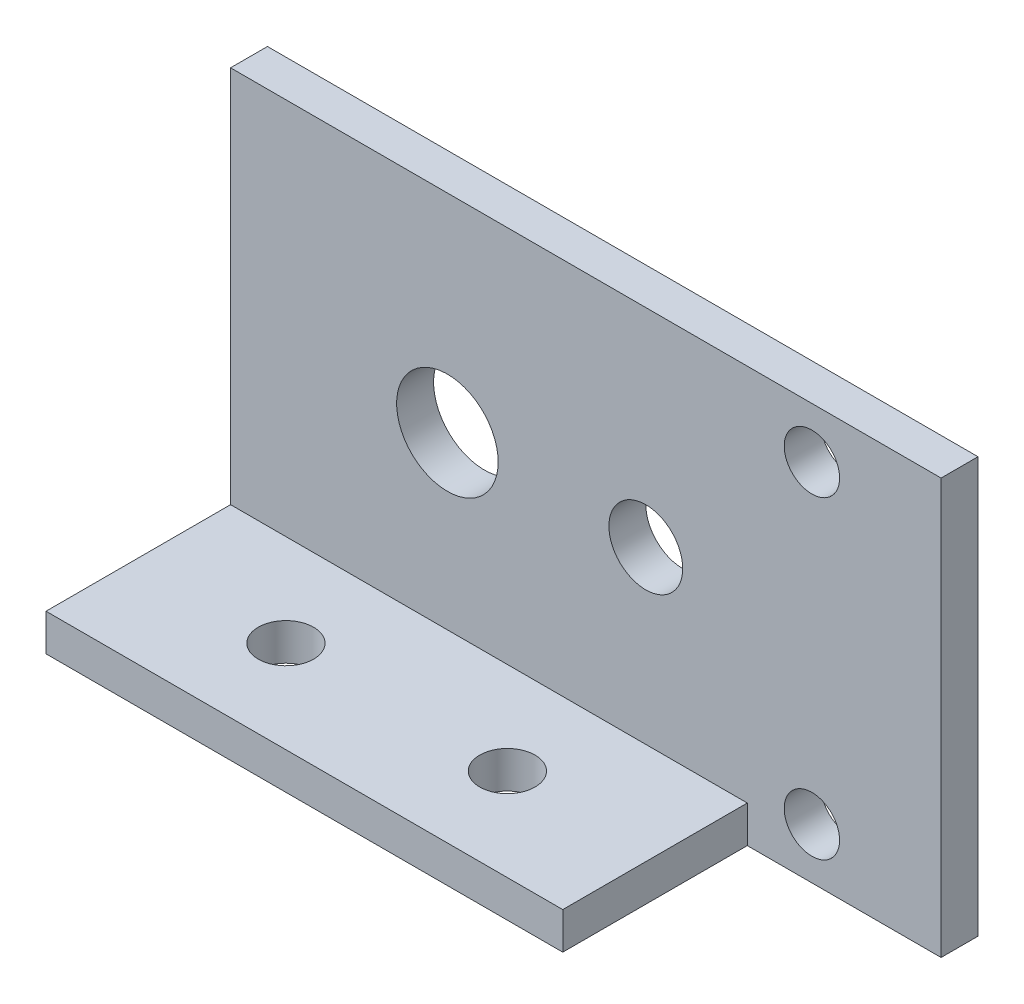
ISO-10303-21;
HEADER;
FILE_DESCRIPTION(('STEP AP214'),'2;1');
FILE_NAME('part.step','',(''),(''),'','','');
FILE_SCHEMA(('AUTOMOTIVE_DESIGN { 1 0 10303 214 1 1 1 1 }'));
ENDSEC;
DATA;
#1=APPLICATION_CONTEXT('core data for automotive mechanical design processes');
#2=APPLICATION_PROTOCOL_DEFINITION('international standard','automotive_design',2000,#1);
#3=PRODUCT_CONTEXT('',#1,'mechanical');
#4=PRODUCT('Part','Part','',(#3));
#5=PRODUCT_RELATED_PRODUCT_CATEGORY('part','',(#4));
#6=PRODUCT_DEFINITION_FORMATION('','',#4);
#7=PRODUCT_DEFINITION_CONTEXT('part definition',#1,'design');
#8=PRODUCT_DEFINITION('design','',#6,#7);
#9=PRODUCT_DEFINITION_SHAPE('','',#8);
#10=(LENGTH_UNIT() NAMED_UNIT(*) SI_UNIT(.MILLI.,.METRE.));
#11=(NAMED_UNIT(*) PLANE_ANGLE_UNIT() SI_UNIT($,.RADIAN.));
#12=(NAMED_UNIT(*) SI_UNIT($,.STERADIAN.) SOLID_ANGLE_UNIT());
#13=UNCERTAINTY_MEASURE_WITH_UNIT(LENGTH_MEASURE(1.E-05),#10,'distance_accuracy_value','');
#14=(GEOMETRIC_REPRESENTATION_CONTEXT(3) GLOBAL_UNCERTAINTY_ASSIGNED_CONTEXT((#13)) GLOBAL_UNIT_ASSIGNED_CONTEXT((#10,
#11,#12)) REPRESENTATION_CONTEXT('',''));
#15=CARTESIAN_POINT('',(0.,0.,0.));
#16=DIRECTION('',(0.,0.,1.));
#17=DIRECTION('',(1.,0.,0.));
#18=AXIS2_PLACEMENT_3D('',#15,#16,#17);
#19=CARTESIAN_POINT('',(0.,0.,2.));
#20=DIRECTION('',(0.,0.,1.));
#21=DIRECTION('',(1.,0.,0.));
#22=AXIS2_PLACEMENT_3D('',#19,#20,#21);
#23=PLANE('',#22);
#24=DIRECTION('',(-1.,0.,0.));
#25=VECTOR('',#24,1.);
#26=CARTESIAN_POINT('',(8.75,-9.25,2.));
#27=LINE('',#26,#25);
#28=CARTESIAN_POINT('',(8.75,-9.25,2.));
#29=VERTEX_POINT('',#28);
#30=CARTESIAN_POINT('',(-19.25,-9.25,2.));
#31=VERTEX_POINT('',#30);
#32=EDGE_CURVE('E127',#29,#31,#27,.T.);
#33=ORIENTED_EDGE('',*,*,#32,.F.);
#34=DIRECTION('',(0.,-1.,0.));
#35=VECTOR('',#34,1.);
#36=CARTESIAN_POINT('',(8.75,-11.25,2.));
#37=LINE('',#36,#35);
#38=CARTESIAN_POINT('',(8.74999999999999,-11.25,2.));
#39=VERTEX_POINT('',#38);
#40=EDGE_CURVE('E118',#29,#39,#37,.T.);
#41=ORIENTED_EDGE('',*,*,#40,.T.);
#42=DIRECTION('',(1.,0.,0.));
#43=VECTOR('',#42,1.);
#44=CARTESIAN_POINT('',(-19.25,-11.25,2.));
#45=LINE('',#44,#43);
#46=CARTESIAN_POINT('',(19.25,-11.25,2.));
#47=VERTEX_POINT('',#46);
#48=EDGE_CURVE('E58',#39,#47,#45,.T.);
#49=ORIENTED_EDGE('',*,*,#48,.T.);
#50=DIRECTION('',(0.,1.,0.));
#51=VECTOR('',#50,1.);
#52=CARTESIAN_POINT('',(19.25,11.25,2.));
#53=LINE('',#52,#51);
#54=CARTESIAN_POINT('',(19.25,11.25,2.));
#55=VERTEX_POINT('',#54);
#56=EDGE_CURVE('E168',#47,#55,#53,.T.);
#57=ORIENTED_EDGE('',*,*,#56,.T.);
#58=DIRECTION('',(-1.,0.,0.));
#59=VECTOR('',#58,1.);
#60=CARTESIAN_POINT('',(-19.25,11.25,2.));
#61=LINE('',#60,#59);
#62=CARTESIAN_POINT('',(-19.25,11.25,2.));
#63=VERTEX_POINT('',#62);
#64=EDGE_CURVE('E84',#55,#63,#61,.T.);
#65=ORIENTED_EDGE('',*,*,#64,.T.);
#66=DIRECTION('',(0.,-1.,0.));
#67=VECTOR('',#66,1.);
#68=CARTESIAN_POINT('',(-19.25,11.25,2.));
#69=LINE('',#68,#67);
#70=EDGE_CURVE('E171',#63,#31,#69,.T.);
#71=ORIENTED_EDGE('',*,*,#70,.T.);
#72=EDGE_LOOP('',(#33,#41,#49,#57,#65,#71));
#73=FACE_BOUND('',#72,.T.);
#74=CARTESIAN_POINT('',(12.25,-8.5,2.));
#75=DIRECTION('',(0.,0.,1.));
#76=DIRECTION('',(1.,0.,0.));
#77=AXIS2_PLACEMENT_3D('',#74,#75,#76);
#78=CIRCLE('',#77,1.5);
#79=CARTESIAN_POINT('',(13.75,-8.5,2.));
#80=VERTEX_POINT('',#79);
#81=EDGE_CURVE('E150',#80,#80,#78,.T.);
#82=ORIENTED_EDGE('',*,*,#81,.F.);
#83=EDGE_LOOP('',(#82));
#84=FACE_BOUND('',#83,.T.);
#85=CARTESIAN_POINT('',(-7.5,0.,2.));
#86=DIRECTION('',(0.,0.,1.));
#87=DIRECTION('',(1.,0.,0.));
#88=AXIS2_PLACEMENT_3D('',#85,#86,#87);
#89=CIRCLE('',#88,2.75);
#90=CARTESIAN_POINT('',(-4.75,0.,2.));
#91=VERTEX_POINT('',#90);
#92=EDGE_CURVE('E162',#91,#91,#89,.T.);
#93=ORIENTED_EDGE('',*,*,#92,.F.);
#94=EDGE_LOOP('',(#93));
#95=FACE_BOUND('',#94,.T.);
#96=CARTESIAN_POINT('',(3.25,0.,2.));
#97=DIRECTION('',(0.,0.,1.));
#98=DIRECTION('',(1.,0.,0.));
#99=AXIS2_PLACEMENT_3D('',#96,#97,#98);
#100=CIRCLE('',#99,2.);
#101=CARTESIAN_POINT('',(5.25,0.,2.));
#102=VERTEX_POINT('',#101);
#103=EDGE_CURVE('E156',#102,#102,#100,.T.);
#104=ORIENTED_EDGE('',*,*,#103,.F.);
#105=EDGE_LOOP('',(#104));
#106=FACE_BOUND('',#105,.T.);
#107=CARTESIAN_POINT('',(12.25,8.5,2.));
#108=DIRECTION('',(0.,0.,1.));
#109=DIRECTION('',(1.,0.,0.));
#110=AXIS2_PLACEMENT_3D('',#107,#108,#109);
#111=CIRCLE('',#110,1.5);
#112=CARTESIAN_POINT('',(13.75,8.5,2.));
#113=VERTEX_POINT('',#112);
#114=EDGE_CURVE('E144',#113,#113,#111,.T.);
#115=ORIENTED_EDGE('',*,*,#114,.F.);
#116=EDGE_LOOP('',(#115));
#117=FACE_BOUND('',#116,.T.);
#118=ADVANCED_FACE('F33',(#73,#84,#95,#106,#117),#23,.T.);
#119=CARTESIAN_POINT('',(0.,0.,0.));
#120=DIRECTION('',(0.,0.,1.));
#121=DIRECTION('',(1.,0.,0.));
#122=AXIS2_PLACEMENT_3D('',#119,#120,#121);
#123=PLANE('',#122);
#124=CARTESIAN_POINT('',(12.25,-8.5,0.));
#125=DIRECTION('',(0.,0.,1.));
#126=DIRECTION('',(1.,0.,0.));
#127=AXIS2_PLACEMENT_3D('',#124,#125,#126);
#128=CIRCLE('',#127,1.5);
#129=CARTESIAN_POINT('',(13.75,-8.5,0.));
#130=VERTEX_POINT('',#129);
#131=EDGE_CURVE('E147',#130,#130,#128,.T.);
#132=ORIENTED_EDGE('',*,*,#131,.T.);
#133=EDGE_LOOP('',(#132));
#134=FACE_BOUND('',#133,.T.);
#135=CARTESIAN_POINT('',(-7.5,0.,0.));
#136=DIRECTION('',(0.,0.,1.));
#137=DIRECTION('',(1.,0.,0.));
#138=AXIS2_PLACEMENT_3D('',#135,#136,#137);
#139=CIRCLE('',#138,2.75);
#140=CARTESIAN_POINT('',(-4.75,0.,0.));
#141=VERTEX_POINT('',#140);
#142=EDGE_CURVE('E159',#141,#141,#139,.T.);
#143=ORIENTED_EDGE('',*,*,#142,.T.);
#144=EDGE_LOOP('',(#143));
#145=FACE_BOUND('',#144,.T.);
#146=DIRECTION('',(0.,1.,0.));
#147=VECTOR('',#146,1.);
#148=CARTESIAN_POINT('',(19.25,11.25,0.));
#149=LINE('',#148,#147);
#150=CARTESIAN_POINT('',(19.25,-11.25,0.));
#151=VERTEX_POINT('',#150);
#152=CARTESIAN_POINT('',(19.25,11.25,0.));
#153=VERTEX_POINT('',#152);
#154=EDGE_CURVE('E165',#151,#153,#149,.T.);
#155=ORIENTED_EDGE('',*,*,#154,.F.);
#156=DIRECTION('',(1.,0.,0.));
#157=VECTOR('',#156,1.);
#158=CARTESIAN_POINT('',(-19.25,-11.25,0.));
#159=LINE('',#158,#157);
#160=CARTESIAN_POINT('',(-19.25,-11.25,0.));
#161=VERTEX_POINT('',#160);
#162=EDGE_CURVE('E79',#161,#151,#159,.T.);
#163=ORIENTED_EDGE('',*,*,#162,.F.);
#164=DIRECTION('',(0.,-1.,0.));
#165=VECTOR('',#164,1.);
#166=CARTESIAN_POINT('',(-19.25,11.25,0.));
#167=LINE('',#166,#165);
#168=CARTESIAN_POINT('',(-19.25,11.25,0.));
#169=VERTEX_POINT('',#168);
#170=EDGE_CURVE('E191',#169,#161,#167,.T.);
#171=ORIENTED_EDGE('',*,*,#170,.F.);
#172=DIRECTION('',(-1.,0.,0.));
#173=VECTOR('',#172,1.);
#174=CARTESIAN_POINT('',(-19.25,11.25,0.));
#175=LINE('',#174,#173);
#176=EDGE_CURVE('E195',#153,#169,#175,.T.);
#177=ORIENTED_EDGE('',*,*,#176,.F.);
#178=EDGE_LOOP('',(#155,#163,#171,#177));
#179=FACE_BOUND('',#178,.T.);
#180=CARTESIAN_POINT('',(3.25,0.,0.));
#181=DIRECTION('',(0.,0.,1.));
#182=DIRECTION('',(1.,0.,0.));
#183=AXIS2_PLACEMENT_3D('',#180,#181,#182);
#184=CIRCLE('',#183,2.);
#185=CARTESIAN_POINT('',(5.25,0.,0.));
#186=VERTEX_POINT('',#185);
#187=EDGE_CURVE('E153',#186,#186,#184,.T.);
#188=ORIENTED_EDGE('',*,*,#187,.T.);
#189=EDGE_LOOP('',(#188));
#190=FACE_BOUND('',#189,.T.);
#191=CARTESIAN_POINT('',(12.25,8.5,0.));
#192=DIRECTION('',(0.,0.,1.));
#193=DIRECTION('',(1.,0.,0.));
#194=AXIS2_PLACEMENT_3D('',#191,#192,#193);
#195=CIRCLE('',#194,1.5);
#196=CARTESIAN_POINT('',(13.75,8.5,0.));
#197=VERTEX_POINT('',#196);
#198=EDGE_CURVE('E129',#197,#197,#195,.T.);
#199=ORIENTED_EDGE('',*,*,#198,.T.);
#200=EDGE_LOOP('',(#199));
#201=FACE_BOUND('',#200,.T.);
#202=ADVANCED_FACE('F193',(#134,#145,#179,#190,#201),#123,.F.);
#203=CARTESIAN_POINT('',(19.25,11.25,2.));
#204=DIRECTION('',(-1.,0.,0.));
#205=DIRECTION('',(0.,-1.,0.));
#206=AXIS2_PLACEMENT_3D('',#203,#204,#205);
#207=PLANE('',#206);
#208=ORIENTED_EDGE('',*,*,#154,.T.);
#209=DIRECTION('',(0.,0.,-1.));
#210=VECTOR('',#209,1.);
#211=CARTESIAN_POINT('',(19.25,11.25,2.));
#212=LINE('',#211,#210);
#213=EDGE_CURVE('E11',#55,#153,#212,.T.);
#214=ORIENTED_EDGE('',*,*,#213,.F.);
#215=ORIENTED_EDGE('',*,*,#56,.F.);
#216=DIRECTION('',(0.,0.,-1.));
#217=VECTOR('',#216,1.);
#218=CARTESIAN_POINT('',(19.25,-11.25,2.));
#219=LINE('',#218,#217);
#220=EDGE_CURVE('E178',#47,#151,#219,.T.);
#221=ORIENTED_EDGE('',*,*,#220,.T.);
#222=EDGE_LOOP('',(#208,#214,#215,#221));
#223=FACE_BOUND('',#222,.T.);
#224=ADVANCED_FACE('F35',(#223),#207,.F.);
#225=CARTESIAN_POINT('',(-19.25,11.25,2.));
#226=DIRECTION('',(0.,-1.,0.));
#227=DIRECTION('',(0.,0.,-1.));
#228=AXIS2_PLACEMENT_3D('',#225,#226,#227);
#229=PLANE('',#228);
#230=ORIENTED_EDGE('',*,*,#176,.T.);
#231=DIRECTION('',(0.,0.,-1.));
#232=VECTOR('',#231,1.);
#233=CARTESIAN_POINT('',(-19.25,11.25,2.));
#234=LINE('',#233,#232);
#235=EDGE_CURVE('E42',#63,#169,#234,.T.);
#236=ORIENTED_EDGE('',*,*,#235,.F.);
#237=ORIENTED_EDGE('',*,*,#64,.F.);
#238=ORIENTED_EDGE('',*,*,#213,.T.);
#239=EDGE_LOOP('',(#230,#236,#237,#238));
#240=FACE_BOUND('',#239,.T.);
#241=ADVANCED_FACE('F198',(#240),#229,.F.);
#242=CARTESIAN_POINT('',(-19.25,11.25,2.));
#243=DIRECTION('',(1.,0.,0.));
#244=DIRECTION('',(0.,0.,-1.));
#245=AXIS2_PLACEMENT_3D('',#242,#243,#244);
#246=PLANE('',#245);
#247=ORIENTED_EDGE('',*,*,#170,.T.);
#248=DIRECTION('',(0.,0.,-1.));
#249=VECTOR('',#248,1.);
#250=CARTESIAN_POINT('',(-19.25,-11.25,2.));
#251=LINE('',#250,#249);
#252=CARTESIAN_POINT('',(-19.25,-11.25,12.));
#253=VERTEX_POINT('',#252);
#254=EDGE_CURVE('E179',#253,#161,#251,.T.);
#255=ORIENTED_EDGE('',*,*,#254,.F.);
#256=DIRECTION('',(0.,1.,0.));
#257=VECTOR('',#256,1.);
#258=CARTESIAN_POINT('',(-19.25,-11.25,12.));
#259=LINE('',#258,#257);
#260=CARTESIAN_POINT('',(-19.25,-9.25,12.));
#261=VERTEX_POINT('',#260);
#262=EDGE_CURVE('E110',#253,#261,#259,.T.);
#263=ORIENTED_EDGE('',*,*,#262,.T.);
#264=DIRECTION('',(0.,0.,-1.));
#265=VECTOR('',#264,1.);
#266=CARTESIAN_POINT('',(-19.25,-9.25,2.));
#267=LINE('',#266,#265);
#268=EDGE_CURVE('E120',#261,#31,#267,.T.);
#269=ORIENTED_EDGE('',*,*,#268,.T.);
#270=ORIENTED_EDGE('',*,*,#70,.F.);
#271=ORIENTED_EDGE('',*,*,#235,.T.);
#272=EDGE_LOOP('',(#247,#255,#263,#269,#270,#271));
#273=FACE_BOUND('',#272,.T.);
#274=ADVANCED_FACE('F190',(#273),#246,.F.);
#275=CARTESIAN_POINT('',(-19.25,-11.25,2.));
#276=DIRECTION('',(0.,1.,0.));
#277=DIRECTION('',(0.,0.,1.));
#278=AXIS2_PLACEMENT_3D('',#275,#276,#277);
#279=PLANE('',#278);
#280=CARTESIAN_POINT('',(0.750000000000001,-11.25,7.));
#281=DIRECTION('',(0.,1.,0.));
#282=DIRECTION('',(0.,0.,1.));
#283=AXIS2_PLACEMENT_3D('',#280,#281,#282);
#284=CIRCLE('',#283,1.5);
#285=CARTESIAN_POINT('',(0.750000000000001,-11.25,8.5));
#286=VERTEX_POINT('',#285);
#287=EDGE_CURVE('E228',#286,#286,#284,.T.);
#288=ORIENTED_EDGE('',*,*,#287,.T.);
#289=EDGE_LOOP('',(#288));
#290=FACE_BOUND('',#289,.T.);
#291=CARTESIAN_POINT('',(-11.25,-11.25,7.));
#292=DIRECTION('',(0.,1.,0.));
#293=DIRECTION('',(0.,0.,1.));
#294=AXIS2_PLACEMENT_3D('',#291,#292,#293);
#295=CIRCLE('',#294,1.5);
#296=CARTESIAN_POINT('',(-11.25,-11.25,8.5));
#297=VERTEX_POINT('',#296);
#298=EDGE_CURVE('E136',#297,#297,#295,.T.);
#299=ORIENTED_EDGE('',*,*,#298,.T.);
#300=EDGE_LOOP('',(#299));
#301=FACE_BOUND('',#300,.T.);
#302=ORIENTED_EDGE('',*,*,#162,.T.);
#303=ORIENTED_EDGE('',*,*,#220,.F.);
#304=ORIENTED_EDGE('',*,*,#48,.F.);
#305=DIRECTION('',(0.,0.,1.));
#306=VECTOR('',#305,1.);
#307=CARTESIAN_POINT('',(8.75,-11.25,2.));
#308=LINE('',#307,#306);
#309=CARTESIAN_POINT('',(8.75,-11.25,12.));
#310=VERTEX_POINT('',#309);
#311=EDGE_CURVE('E50',#39,#310,#308,.T.);
#312=ORIENTED_EDGE('',*,*,#311,.T.);
#313=DIRECTION('',(-1.,0.,0.));
#314=VECTOR('',#313,1.);
#315=CARTESIAN_POINT('',(8.75,-11.25,12.));
#316=LINE('',#315,#314);
#317=EDGE_CURVE('E105',#310,#253,#316,.T.);
#318=ORIENTED_EDGE('',*,*,#317,.T.);
#319=ORIENTED_EDGE('',*,*,#254,.T.);
#320=EDGE_LOOP('',(#302,#303,#304,#312,#318,#319));
#321=FACE_BOUND('',#320,.T.);
#322=ADVANCED_FACE('F117',(#290,#301,#321),#279,.F.);
#323=CARTESIAN_POINT('',(-7.5,0.,2.));
#324=DIRECTION('',(0.,0.,-1.));
#325=DIRECTION('',(-1.,0.,0.));
#326=AXIS2_PLACEMENT_3D('',#323,#324,#325);
#327=CYLINDRICAL_SURFACE('',#326,2.75);
#328=ORIENTED_EDGE('',*,*,#92,.T.);
#329=EDGE_LOOP('',(#328));
#330=FACE_BOUND('',#329,.T.);
#331=ORIENTED_EDGE('',*,*,#142,.F.);
#332=EDGE_LOOP('',(#331));
#333=FACE_BOUND('',#332,.T.);
#334=ADVANCED_FACE('F215',(#330,#333),#327,.F.);
#335=CARTESIAN_POINT('',(3.25,0.,2.));
#336=DIRECTION('',(0.,0.,-1.));
#337=DIRECTION('',(-1.,0.,0.));
#338=AXIS2_PLACEMENT_3D('',#335,#336,#337);
#339=CYLINDRICAL_SURFACE('',#338,2.);
#340=ORIENTED_EDGE('',*,*,#103,.T.);
#341=EDGE_LOOP('',(#340));
#342=FACE_BOUND('',#341,.T.);
#343=ORIENTED_EDGE('',*,*,#187,.F.);
#344=EDGE_LOOP('',(#343));
#345=FACE_BOUND('',#344,.T.);
#346=ADVANCED_FACE('F223',(#342,#345),#339,.F.);
#347=CARTESIAN_POINT('',(12.25,-8.5,2.));
#348=DIRECTION('',(0.,0.,-1.));
#349=DIRECTION('',(-1.,0.,0.));
#350=AXIS2_PLACEMENT_3D('',#347,#348,#349);
#351=CYLINDRICAL_SURFACE('',#350,1.5);
#352=ORIENTED_EDGE('',*,*,#81,.T.);
#353=EDGE_LOOP('',(#352));
#354=FACE_BOUND('',#353,.T.);
#355=ORIENTED_EDGE('',*,*,#131,.F.);
#356=EDGE_LOOP('',(#355));
#357=FACE_BOUND('',#356,.T.);
#358=ADVANCED_FACE('F254',(#354,#357),#351,.F.);
#359=CARTESIAN_POINT('',(12.25,8.5,2.));
#360=DIRECTION('',(0.,0.,-1.));
#361=DIRECTION('',(-1.,0.,0.));
#362=AXIS2_PLACEMENT_3D('',#359,#360,#361);
#363=CYLINDRICAL_SURFACE('',#362,1.5);
#364=ORIENTED_EDGE('',*,*,#114,.T.);
#365=EDGE_LOOP('',(#364));
#366=FACE_BOUND('',#365,.T.);
#367=ORIENTED_EDGE('',*,*,#198,.F.);
#368=EDGE_LOOP('',(#367));
#369=FACE_BOUND('',#368,.T.);
#370=ADVANCED_FACE('F248',(#366,#369),#363,.F.);
#371=CARTESIAN_POINT('',(8.75,-9.25,2.));
#372=DIRECTION('',(0.,1.,0.));
#373=DIRECTION('',(0.,0.,1.));
#374=AXIS2_PLACEMENT_3D('',#371,#372,#373);
#375=PLANE('',#374);
#376=CARTESIAN_POINT('',(0.750000000000001,-9.25,7.));
#377=DIRECTION('',(0.,1.,0.));
#378=DIRECTION('',(0.,0.,1.));
#379=AXIS2_PLACEMENT_3D('',#376,#377,#378);
#380=CIRCLE('',#379,1.5);
#381=CARTESIAN_POINT('',(0.750000000000001,-9.25,8.5));
#382=VERTEX_POINT('',#381);
#383=EDGE_CURVE('E368',#382,#382,#380,.T.);
#384=ORIENTED_EDGE('',*,*,#383,.F.);
#385=EDGE_LOOP('',(#384));
#386=FACE_BOUND('',#385,.T.);
#387=CARTESIAN_POINT('',(-11.25,-9.25,7.));
#388=DIRECTION('',(0.,1.,0.));
#389=DIRECTION('',(0.,0.,1.));
#390=AXIS2_PLACEMENT_3D('',#387,#388,#389);
#391=CIRCLE('',#390,1.5);
#392=CARTESIAN_POINT('',(-11.25,-9.25,8.5));
#393=VERTEX_POINT('',#392);
#394=EDGE_CURVE('E139',#393,#393,#391,.T.);
#395=ORIENTED_EDGE('',*,*,#394,.F.);
#396=EDGE_LOOP('',(#395));
#397=FACE_BOUND('',#396,.T.);
#398=ORIENTED_EDGE('',*,*,#268,.F.);
#399=DIRECTION('',(-1.,0.,0.));
#400=VECTOR('',#399,1.);
#401=CARTESIAN_POINT('',(8.75,-9.25,12.));
#402=LINE('',#401,#400);
#403=CARTESIAN_POINT('',(8.75,-9.25,12.));
#404=VERTEX_POINT('',#403);
#405=EDGE_CURVE('E111',#404,#261,#402,.T.);
#406=ORIENTED_EDGE('',*,*,#405,.F.);
#407=DIRECTION('',(0.,0.,-1.));
#408=VECTOR('',#407,1.);
#409=CARTESIAN_POINT('',(8.75,-9.25,2.));
#410=LINE('',#409,#408);
#411=EDGE_CURVE('E112',#404,#29,#410,.T.);
#412=ORIENTED_EDGE('',*,*,#411,.T.);
#413=ORIENTED_EDGE('',*,*,#32,.T.);
#414=EDGE_LOOP('',(#398,#406,#412,#413));
#415=FACE_BOUND('',#414,.T.);
#416=ADVANCED_FACE('F245',(#386,#397,#415),#375,.T.);
#417=CARTESIAN_POINT('',(8.75,-11.25,12.));
#418=DIRECTION('',(0.,0.,1.));
#419=DIRECTION('',(1.,0.,0.));
#420=AXIS2_PLACEMENT_3D('',#417,#418,#419);
#421=PLANE('',#420);
#422=ORIENTED_EDGE('',*,*,#262,.F.);
#423=ORIENTED_EDGE('',*,*,#317,.F.);
#424=DIRECTION('',(0.,1.,0.));
#425=VECTOR('',#424,1.);
#426=CARTESIAN_POINT('',(8.75,-11.25,12.));
#427=LINE('',#426,#425);
#428=EDGE_CURVE('E107',#310,#404,#427,.T.);
#429=ORIENTED_EDGE('',*,*,#428,.T.);
#430=ORIENTED_EDGE('',*,*,#405,.T.);
#431=EDGE_LOOP('',(#422,#423,#429,#430));
#432=FACE_BOUND('',#431,.T.);
#433=ADVANCED_FACE('F106',(#432),#421,.T.);
#434=CARTESIAN_POINT('',(8.75,0.,0.));
#435=DIRECTION('',(1.,0.,0.));
#436=DIRECTION('',(0.,0.,-1.));
#437=AXIS2_PLACEMENT_3D('',#434,#435,#436);
#438=PLANE('',#437);
#439=ORIENTED_EDGE('',*,*,#40,.F.);
#440=ORIENTED_EDGE('',*,*,#411,.F.);
#441=ORIENTED_EDGE('',*,*,#428,.F.);
#442=ORIENTED_EDGE('',*,*,#311,.F.);
#443=EDGE_LOOP('',(#439,#440,#441,#442));
#444=FACE_BOUND('',#443,.T.);
#445=ADVANCED_FACE('F114',(#444),#438,.T.);
#446=CARTESIAN_POINT('',(-11.25,-14.25,7.));
#447=DIRECTION('',(0.,1.,0.));
#448=DIRECTION('',(0.,0.,1.));
#449=AXIS2_PLACEMENT_3D('',#446,#447,#448);
#450=CYLINDRICAL_SURFACE('',#449,1.5);
#451=ORIENTED_EDGE('',*,*,#394,.T.);
#452=EDGE_LOOP('',(#451));
#453=FACE_BOUND('',#452,.T.);
#454=ORIENTED_EDGE('',*,*,#298,.F.);
#455=EDGE_LOOP('',(#454));
#456=FACE_BOUND('',#455,.T.);
#457=ADVANCED_FACE('F231',(#453,#456),#450,.F.);
#458=CARTESIAN_POINT('',(0.750000000000001,-14.25,7.));
#459=DIRECTION('',(0.,1.,0.));
#460=DIRECTION('',(0.,0.,1.));
#461=AXIS2_PLACEMENT_3D('',#458,#459,#460);
#462=CYLINDRICAL_SURFACE('',#461,1.5);
#463=ORIENTED_EDGE('',*,*,#383,.T.);
#464=EDGE_LOOP('',(#463));
#465=FACE_BOUND('',#464,.T.);
#466=ORIENTED_EDGE('',*,*,#287,.F.);
#467=EDGE_LOOP('',(#466));
#468=FACE_BOUND('',#467,.T.);
#469=ADVANCED_FACE('F233',(#465,#468),#462,.F.);
#470=CLOSED_SHELL('',(#118,#202,#224,#241,#274,#322,#334,#346,#358,#370,#416,#433,#445,#457,#469));
#471=MANIFOLD_SOLID_BREP('B2',#470);
#472=ADVANCED_BREP_SHAPE_REPRESENTATION('',(#18,#471),#14);
#473=SHAPE_DEFINITION_REPRESENTATION(#9,#472);
ENDSEC;
END-ISO-10303-21;
